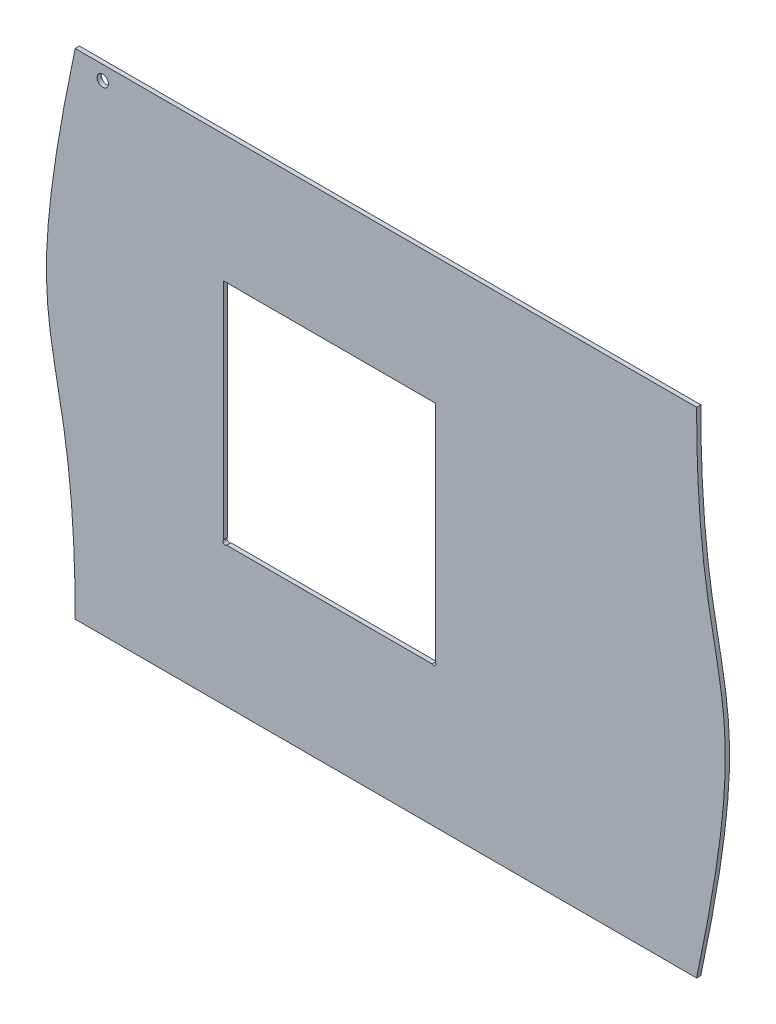
ISO-10303-21;
HEADER;
FILE_DESCRIPTION(('STEP AP214'),'2;1');
FILE_NAME('part.step','',(''),(''),'','','');
FILE_SCHEMA(('AUTOMOTIVE_DESIGN { 1 0 10303 214 1 1 1 1 }'));
ENDSEC;
DATA;
#1=APPLICATION_CONTEXT('core data for automotive mechanical design processes');
#2=APPLICATION_PROTOCOL_DEFINITION('international standard','automotive_design',2000,#1);
#3=PRODUCT_CONTEXT('',#1,'mechanical');
#4=PRODUCT('Part','Part','',(#3));
#5=PRODUCT_RELATED_PRODUCT_CATEGORY('part','',(#4));
#6=PRODUCT_DEFINITION_FORMATION('','',#4);
#7=PRODUCT_DEFINITION_CONTEXT('part definition',#1,'design');
#8=PRODUCT_DEFINITION('design','',#6,#7);
#9=PRODUCT_DEFINITION_SHAPE('','',#8);
#10=(LENGTH_UNIT() NAMED_UNIT(*) SI_UNIT(.MILLI.,.METRE.));
#11=(NAMED_UNIT(*) PLANE_ANGLE_UNIT() SI_UNIT($,.RADIAN.));
#12=(NAMED_UNIT(*) SI_UNIT($,.STERADIAN.) SOLID_ANGLE_UNIT());
#13=UNCERTAINTY_MEASURE_WITH_UNIT(LENGTH_MEASURE(1.E-05),#10,'distance_accuracy_value','');
#14=(GEOMETRIC_REPRESENTATION_CONTEXT(3) GLOBAL_UNCERTAINTY_ASSIGNED_CONTEXT((#13)) GLOBAL_UNIT_ASSIGNED_CONTEXT((#10,
#11,#12)) REPRESENTATION_CONTEXT('',''));
#15=CARTESIAN_POINT('',(0.,0.,0.));
#16=DIRECTION('',(0.,0.,1.));
#17=DIRECTION('',(1.,0.,0.));
#18=AXIS2_PLACEMENT_3D('',#15,#16,#17);
#19=CARTESIAN_POINT('',(447.160764324478,194.031130057544,3.));
#20=DIRECTION('',(0.,0.,-1.));
#21=DIRECTION('',(-1.,0.,0.));
#22=AXIS2_PLACEMENT_3D('',#19,#20,#21);
#23=PLANE('',#22);
#24=DIRECTION('',(-1.,0.,0.));
#25=VECTOR('',#24,1.);
#26=CARTESIAN_POINT('',(245.,268.,3.));
#27=LINE('',#26,#25);
#28=CARTESIAN_POINT('',(245.,268.,3.));
#29=VERTEX_POINT('',#28);
#30=CARTESIAN_POINT('',(95.,268.,3.));
#31=VERTEX_POINT('',#30);
#32=EDGE_CURVE('E110',#29,#31,#27,.T.);
#33=ORIENTED_EDGE('',*,*,#32,.F.);
#34=DIRECTION('',(0.,1.,0.));
#35=VECTOR('',#34,1.);
#36=CARTESIAN_POINT('',(245.,109.262741699797,3.));
#37=LINE('',#36,#35);
#38=CARTESIAN_POINT('',(245.,109.262741699797,3.));
#39=VERTEX_POINT('',#38);
#40=EDGE_CURVE('E141',#39,#29,#37,.T.);
#41=ORIENTED_EDGE('',*,*,#40,.F.);
#42=CARTESIAN_POINT('',(243.868629150102,108.131370849899,3.));
#43=DIRECTION('',(0.,0.,1.));
#44=DIRECTION('',(-1.,0.,0.));
#45=AXIS2_PLACEMENT_3D('',#42,#43,#44);
#46=CIRCLE('',#45,1.60000000000002);
#47=CARTESIAN_POINT('',(242.737258300203,107.,3.));
#48=VERTEX_POINT('',#47);
#49=EDGE_CURVE('E139',#48,#39,#46,.T.);
#50=ORIENTED_EDGE('',*,*,#49,.F.);
#51=DIRECTION('',(1.,0.,0.));
#52=VECTOR('',#51,1.);
#53=CARTESIAN_POINT('',(97.262741699797,107.,3.));
#54=LINE('',#53,#52);
#55=CARTESIAN_POINT('',(97.262741699797,107.,3.));
#56=VERTEX_POINT('',#55);
#57=EDGE_CURVE('E134',#56,#48,#54,.T.);
#58=ORIENTED_EDGE('',*,*,#57,.F.);
#59=CARTESIAN_POINT('',(96.1313708498985,108.131370849898,3.));
#60=DIRECTION('',(0.,0.,1.));
#61=DIRECTION('',(1.,0.,0.));
#62=AXIS2_PLACEMENT_3D('',#59,#60,#61);
#63=CIRCLE('',#62,1.6);
#64=CARTESIAN_POINT('',(95.,109.262741699797,3.));
#65=VERTEX_POINT('',#64);
#66=EDGE_CURVE('E132',#65,#56,#63,.T.);
#67=ORIENTED_EDGE('',*,*,#66,.F.);
#68=DIRECTION('',(0.,-1.,0.));
#69=VECTOR('',#68,1.);
#70=CARTESIAN_POINT('',(95.,268.,3.));
#71=LINE('',#70,#69);
#72=EDGE_CURVE('E118',#31,#65,#71,.T.);
#73=ORIENTED_EDGE('',*,*,#72,.F.);
#74=EDGE_LOOP('',(#33,#41,#50,#58,#67,#73));
#75=FACE_BOUND('',#74,.T.);
#76=CARTESIAN_POINT('',(430.,8.,3.));
#77=CARTESIAN_POINT('',(475.762038198805,224.874934930482,3.));
#78=CARTESIAN_POINT('',(429.999999999804,170.541411889636,3.));
#79=CARTESIAN_POINT('',(430.,358.000000000002,3.));
#80=B_SPLINE_CURVE_WITH_KNOTS('',3,(#76,#77,#78,#79),.UNSPECIFIED.,.F.,.F.,(4,4),(0.,1.),.UNSPECIFIED.);
#81=CARTESIAN_POINT('',(430.,8.,3.));
#82=VERTEX_POINT('',#81);
#83=CARTESIAN_POINT('',(430.,358.,3.));
#84=VERTEX_POINT('',#83);
#85=EDGE_CURVE('E163',#82,#84,#80,.T.);
#86=ORIENTED_EDGE('',*,*,#85,.T.);
#87=DIRECTION('',(-1.,0.,0.));
#88=VECTOR('',#87,1.);
#89=CARTESIAN_POINT('',(-10.0000000000001,358.,3.));
#90=LINE('',#89,#88);
#91=CARTESIAN_POINT('',(-10.,358.,3.));
#92=VERTEX_POINT('',#91);
#93=EDGE_CURVE('E169',#84,#92,#90,.T.);
#94=ORIENTED_EDGE('',*,*,#93,.T.);
#95=CARTESIAN_POINT('',(-10.,358.,3.));
#96=CARTESIAN_POINT('',(-55.7620381988046,141.125065069518,3.));
#97=CARTESIAN_POINT('',(-9.99999999999899,195.458588108931,3.));
#98=CARTESIAN_POINT('',(-9.99999999999995,7.99999999999817,3.));
#99=B_SPLINE_CURVE_WITH_KNOTS('',3,(#95,#96,#97,#98),.UNSPECIFIED.,.F.,.F.,(4,4),(0.,1.),.UNSPECIFIED.);
#100=CARTESIAN_POINT('',(-10.,8.,3.));
#101=VERTEX_POINT('',#100);
#102=EDGE_CURVE('E175',#92,#101,#99,.T.);
#103=ORIENTED_EDGE('',*,*,#102,.T.);
#104=DIRECTION('',(1.,0.,0.));
#105=VECTOR('',#104,1.);
#106=CARTESIAN_POINT('',(-10.,8.,3.));
#107=LINE('',#106,#105);
#108=EDGE_CURVE('E180',#101,#82,#107,.T.);
#109=ORIENTED_EDGE('',*,*,#108,.T.);
#110=EDGE_LOOP('',(#86,#94,#103,#109));
#111=FACE_BOUND('',#110,.T.);
#112=CARTESIAN_POINT('',(9.5,348.,3.));
#113=DIRECTION('',(0.,0.,1.));
#114=DIRECTION('',(1.,0.,0.));
#115=AXIS2_PLACEMENT_3D('',#112,#113,#114);
#116=CIRCLE('',#115,4.);
#117=CARTESIAN_POINT('',(13.5,348.,3.));
#118=VERTEX_POINT('',#117);
#119=EDGE_CURVE('E144',#118,#118,#116,.T.);
#120=ORIENTED_EDGE('',*,*,#119,.F.);
#121=EDGE_LOOP('',(#120));
#122=FACE_BOUND('',#121,.T.);
#123=ADVANCED_FACE('F32',(#75,#111,#122),#23,.F.);
#124=CARTESIAN_POINT('',(447.160764324478,194.031130057544,0.));
#125=DIRECTION('',(0.,0.,-1.));
#126=DIRECTION('',(-1.,0.,0.));
#127=AXIS2_PLACEMENT_3D('',#124,#125,#126);
#128=PLANE('',#127);
#129=DIRECTION('',(0.,1.,0.));
#130=VECTOR('',#129,1.);
#131=CARTESIAN_POINT('',(245.,109.262741699797,0.));
#132=LINE('',#131,#130);
#133=CARTESIAN_POINT('',(245.,109.262741699797,0.));
#134=VERTEX_POINT('',#133);
#135=CARTESIAN_POINT('',(245.,268.,0.));
#136=VERTEX_POINT('',#135);
#137=EDGE_CURVE('E119',#134,#136,#132,.T.);
#138=ORIENTED_EDGE('',*,*,#137,.T.);
#139=DIRECTION('',(-1.,0.,0.));
#140=VECTOR('',#139,1.);
#141=CARTESIAN_POINT('',(245.,268.,0.));
#142=LINE('',#141,#140);
#143=CARTESIAN_POINT('',(95.,268.,0.));
#144=VERTEX_POINT('',#143);
#145=EDGE_CURVE('E56',#136,#144,#142,.T.);
#146=ORIENTED_EDGE('',*,*,#145,.T.);
#147=DIRECTION('',(0.,-1.,0.));
#148=VECTOR('',#147,1.);
#149=CARTESIAN_POINT('',(95.,268.,0.));
#150=LINE('',#149,#148);
#151=CARTESIAN_POINT('',(95.,109.262741699797,0.));
#152=VERTEX_POINT('',#151);
#153=EDGE_CURVE('E125',#144,#152,#150,.T.);
#154=ORIENTED_EDGE('',*,*,#153,.T.);
#155=CARTESIAN_POINT('',(96.1313708498985,108.131370849898,0.));
#156=DIRECTION('',(0.,0.,1.));
#157=DIRECTION('',(1.,0.,0.));
#158=AXIS2_PLACEMENT_3D('',#155,#156,#157);
#159=CIRCLE('',#158,1.6);
#160=CARTESIAN_POINT('',(97.262741699797,107.,0.));
#161=VERTEX_POINT('',#160);
#162=EDGE_CURVE('E146',#152,#161,#159,.T.);
#163=ORIENTED_EDGE('',*,*,#162,.T.);
#164=DIRECTION('',(1.,0.,0.));
#165=VECTOR('',#164,1.);
#166=CARTESIAN_POINT('',(97.262741699797,107.,0.));
#167=LINE('',#166,#165);
#168=CARTESIAN_POINT('',(242.737258300203,107.,0.));
#169=VERTEX_POINT('',#168);
#170=EDGE_CURVE('E149',#161,#169,#167,.T.);
#171=ORIENTED_EDGE('',*,*,#170,.T.);
#172=CARTESIAN_POINT('',(243.868629150102,108.131370849899,0.));
#173=DIRECTION('',(0.,0.,1.));
#174=DIRECTION('',(-1.,0.,0.));
#175=AXIS2_PLACEMENT_3D('',#172,#173,#174);
#176=CIRCLE('',#175,1.60000000000002);
#177=EDGE_CURVE('E152',#169,#134,#176,.T.);
#178=ORIENTED_EDGE('',*,*,#177,.T.);
#179=EDGE_LOOP('',(#138,#146,#154,#163,#171,#178));
#180=FACE_BOUND('',#179,.T.);
#181=CARTESIAN_POINT('',(430.,8.,0.));
#182=CARTESIAN_POINT('',(475.762038198805,224.874934930482,0.));
#183=CARTESIAN_POINT('',(429.999999999804,170.541411889636,0.));
#184=CARTESIAN_POINT('',(430.,358.000000000002,0.));
#185=B_SPLINE_CURVE_WITH_KNOTS('',3,(#181,#182,#183,#184),.UNSPECIFIED.,.F.,.F.,(4,4),(0.,1.),.UNSPECIFIED.);
#186=CARTESIAN_POINT('',(430.,8.,0.));
#187=VERTEX_POINT('',#186);
#188=CARTESIAN_POINT('',(430.,358.,0.));
#189=VERTEX_POINT('',#188);
#190=EDGE_CURVE('E126',#187,#189,#185,.T.);
#191=ORIENTED_EDGE('',*,*,#190,.F.);
#192=DIRECTION('',(1.,0.,0.));
#193=VECTOR('',#192,1.);
#194=CARTESIAN_POINT('',(-10.,8.,0.));
#195=LINE('',#194,#193);
#196=CARTESIAN_POINT('',(-10.,8.,0.));
#197=VERTEX_POINT('',#196);
#198=EDGE_CURVE('E170',#197,#187,#195,.T.);
#199=ORIENTED_EDGE('',*,*,#198,.F.);
#200=CARTESIAN_POINT('',(-10.,358.,0.));
#201=CARTESIAN_POINT('',(-55.7620381988046,141.125065069518,0.));
#202=CARTESIAN_POINT('',(-9.99999999999899,195.458588108931,0.));
#203=CARTESIAN_POINT('',(-9.99999999999995,7.99999999999817,0.));
#204=B_SPLINE_CURVE_WITH_KNOTS('',3,(#200,#201,#202,#203),.UNSPECIFIED.,.F.,.F.,(4,4),(0.,1.),.UNSPECIFIED.);
#205=CARTESIAN_POINT('',(-10.,358.,0.));
#206=VERTEX_POINT('',#205);
#207=EDGE_CURVE('E326',#206,#197,#204,.T.);
#208=ORIENTED_EDGE('',*,*,#207,.F.);
#209=DIRECTION('',(-1.,0.,0.));
#210=VECTOR('',#209,1.);
#211=CARTESIAN_POINT('',(-10.0000000000001,358.,0.));
#212=LINE('',#211,#210);
#213=EDGE_CURVE('E331',#189,#206,#212,.T.);
#214=ORIENTED_EDGE('',*,*,#213,.F.);
#215=EDGE_LOOP('',(#191,#199,#208,#214));
#216=FACE_BOUND('',#215,.T.);
#217=CARTESIAN_POINT('',(9.5,348.,0.));
#218=DIRECTION('',(0.,0.,1.));
#219=DIRECTION('',(1.,0.,0.));
#220=AXIS2_PLACEMENT_3D('',#217,#218,#219);
#221=CIRCLE('',#220,4.);
#222=CARTESIAN_POINT('',(13.5,348.,0.));
#223=VERTEX_POINT('',#222);
#224=EDGE_CURVE('E236',#223,#223,#221,.T.);
#225=ORIENTED_EDGE('',*,*,#224,.T.);
#226=EDGE_LOOP('',(#225));
#227=FACE_BOUND('',#226,.T.);
#228=ADVANCED_FACE('F198',(#180,#216,#227),#128,.T.);
#229=DIRECTION('',(0.,0.,-1.));
#230=VECTOR('',#229,1.);
#231=SURFACE_OF_LINEAR_EXTRUSION('',#80,#230);
#232=ORIENTED_EDGE('',*,*,#190,.T.);
#233=DIRECTION('',(0.,0.,-1.));
#234=VECTOR('',#233,1.);
#235=CARTESIAN_POINT('',(430.,358.,3.));
#236=LINE('',#235,#234);
#237=EDGE_CURVE('E11',#84,#189,#236,.T.);
#238=ORIENTED_EDGE('',*,*,#237,.F.);
#239=ORIENTED_EDGE('',*,*,#85,.F.);
#240=DIRECTION('',(0.,0.,-1.));
#241=VECTOR('',#240,1.);
#242=CARTESIAN_POINT('',(430.,8.,3.));
#243=LINE('',#242,#241);
#244=EDGE_CURVE('E319',#82,#187,#243,.T.);
#245=ORIENTED_EDGE('',*,*,#244,.T.);
#246=EDGE_LOOP('',(#232,#238,#239,#245));
#247=FACE_BOUND('',#246,.T.);
#248=ADVANCED_FACE('F34',(#247),#231,.F.);
#249=CARTESIAN_POINT('',(-10.0000000000001,358.,3.));
#250=DIRECTION('',(0.,-1.,0.));
#251=DIRECTION('',(0.,0.,-1.));
#252=AXIS2_PLACEMENT_3D('',#249,#250,#251);
#253=PLANE('',#252);
#254=ORIENTED_EDGE('',*,*,#213,.T.);
#255=DIRECTION('',(0.,0.,-1.));
#256=VECTOR('',#255,1.);
#257=CARTESIAN_POINT('',(-10.,358.,3.));
#258=LINE('',#257,#256);
#259=EDGE_CURVE('E41',#92,#206,#258,.T.);
#260=ORIENTED_EDGE('',*,*,#259,.F.);
#261=ORIENTED_EDGE('',*,*,#93,.F.);
#262=ORIENTED_EDGE('',*,*,#237,.T.);
#263=EDGE_LOOP('',(#254,#260,#261,#262));
#264=FACE_BOUND('',#263,.T.);
#265=ADVANCED_FACE('F190',(#264),#253,.F.);
#266=DIRECTION('',(0.,0.,-1.));
#267=VECTOR('',#266,1.);
#268=SURFACE_OF_LINEAR_EXTRUSION('',#99,#267);
#269=ORIENTED_EDGE('',*,*,#207,.T.);
#270=DIRECTION('',(0.,0.,-1.));
#271=VECTOR('',#270,1.);
#272=CARTESIAN_POINT('',(-10.,8.,3.));
#273=LINE('',#272,#271);
#274=EDGE_CURVE('E322',#101,#197,#273,.T.);
#275=ORIENTED_EDGE('',*,*,#274,.F.);
#276=ORIENTED_EDGE('',*,*,#102,.F.);
#277=ORIENTED_EDGE('',*,*,#259,.T.);
#278=EDGE_LOOP('',(#269,#275,#276,#277));
#279=FACE_BOUND('',#278,.T.);
#280=ADVANCED_FACE('F186',(#279),#268,.F.);
#281=CARTESIAN_POINT('',(-10.,8.,3.));
#282=DIRECTION('',(0.,1.,0.));
#283=DIRECTION('',(0.,0.,1.));
#284=AXIS2_PLACEMENT_3D('',#281,#282,#283);
#285=PLANE('',#284);
#286=ORIENTED_EDGE('',*,*,#198,.T.);
#287=ORIENTED_EDGE('',*,*,#244,.F.);
#288=ORIENTED_EDGE('',*,*,#108,.F.);
#289=ORIENTED_EDGE('',*,*,#274,.T.);
#290=EDGE_LOOP('',(#286,#287,#288,#289));
#291=FACE_BOUND('',#290,.T.);
#292=ADVANCED_FACE('F189',(#291),#285,.F.);
#293=CARTESIAN_POINT('',(245.,268.,3.));
#294=DIRECTION('',(0.,-1.,0.));
#295=DIRECTION('',(1.,0.,0.));
#296=AXIS2_PLACEMENT_3D('',#293,#294,#295);
#297=PLANE('',#296);
#298=ORIENTED_EDGE('',*,*,#145,.F.);
#299=DIRECTION('',(0.,0.,-1.));
#300=VECTOR('',#299,1.);
#301=CARTESIAN_POINT('',(245.,268.,3.));
#302=LINE('',#301,#300);
#303=EDGE_CURVE('E114',#29,#136,#302,.T.);
#304=ORIENTED_EDGE('',*,*,#303,.F.);
#305=ORIENTED_EDGE('',*,*,#32,.T.);
#306=DIRECTION('',(0.,0.,-1.));
#307=VECTOR('',#306,1.);
#308=CARTESIAN_POINT('',(95.,268.,3.));
#309=LINE('',#308,#307);
#310=EDGE_CURVE('E113',#31,#144,#309,.T.);
#311=ORIENTED_EDGE('',*,*,#310,.T.);
#312=EDGE_LOOP('',(#298,#304,#305,#311));
#313=FACE_BOUND('',#312,.T.);
#314=ADVANCED_FACE('F112',(#313),#297,.T.);
#315=CARTESIAN_POINT('',(95.,268.,3.));
#316=DIRECTION('',(1.,0.,0.));
#317=DIRECTION('',(0.,0.,-1.));
#318=AXIS2_PLACEMENT_3D('',#315,#316,#317);
#319=PLANE('',#318);
#320=ORIENTED_EDGE('',*,*,#153,.F.);
#321=ORIENTED_EDGE('',*,*,#310,.F.);
#322=ORIENTED_EDGE('',*,*,#72,.T.);
#323=DIRECTION('',(0.,0.,-1.));
#324=VECTOR('',#323,1.);
#325=CARTESIAN_POINT('',(95.,109.262741699797,3.));
#326=LINE('',#325,#324);
#327=EDGE_CURVE('E127',#65,#152,#326,.T.);
#328=ORIENTED_EDGE('',*,*,#327,.T.);
#329=EDGE_LOOP('',(#320,#321,#322,#328));
#330=FACE_BOUND('',#329,.T.);
#331=ADVANCED_FACE('F122',(#330),#319,.T.);
#332=CARTESIAN_POINT('',(96.1313708498985,108.131370849898,3.));
#333=DIRECTION('',(0.,0.,-1.));
#334=DIRECTION('',(-1.,0.,0.));
#335=AXIS2_PLACEMENT_3D('',#332,#333,#334);
#336=CYLINDRICAL_SURFACE('',#335,1.6);
#337=ORIENTED_EDGE('',*,*,#162,.F.);
#338=ORIENTED_EDGE('',*,*,#327,.F.);
#339=ORIENTED_EDGE('',*,*,#66,.T.);
#340=DIRECTION('',(0.,0.,-1.));
#341=VECTOR('',#340,1.);
#342=CARTESIAN_POINT('',(97.262741699797,107.,3.));
#343=LINE('',#342,#341);
#344=EDGE_CURVE('E161',#56,#161,#343,.T.);
#345=ORIENTED_EDGE('',*,*,#344,.T.);
#346=EDGE_LOOP('',(#337,#338,#339,#345));
#347=FACE_BOUND('',#346,.T.);
#348=ADVANCED_FACE('F211',(#347),#336,.F.);
#349=CARTESIAN_POINT('',(97.262741699797,107.,3.));
#350=DIRECTION('',(0.,1.,0.));
#351=DIRECTION('',(0.,0.,1.));
#352=AXIS2_PLACEMENT_3D('',#349,#350,#351);
#353=PLANE('',#352);
#354=ORIENTED_EDGE('',*,*,#170,.F.);
#355=ORIENTED_EDGE('',*,*,#344,.F.);
#356=ORIENTED_EDGE('',*,*,#57,.T.);
#357=DIRECTION('',(0.,0.,-1.));
#358=VECTOR('',#357,1.);
#359=CARTESIAN_POINT('',(242.737258300203,107.,3.));
#360=LINE('',#359,#358);
#361=EDGE_CURVE('E159',#48,#169,#360,.T.);
#362=ORIENTED_EDGE('',*,*,#361,.T.);
#363=EDGE_LOOP('',(#354,#355,#356,#362));
#364=FACE_BOUND('',#363,.T.);
#365=ADVANCED_FACE('F214',(#364),#353,.T.);
#366=CARTESIAN_POINT('',(243.868629150102,108.131370849899,3.));
#367=DIRECTION('',(0.,0.,-1.));
#368=DIRECTION('',(-1.,0.,0.));
#369=AXIS2_PLACEMENT_3D('',#366,#367,#368);
#370=CYLINDRICAL_SURFACE('',#369,1.60000000000002);
#371=ORIENTED_EDGE('',*,*,#177,.F.);
#372=ORIENTED_EDGE('',*,*,#361,.F.);
#373=ORIENTED_EDGE('',*,*,#49,.T.);
#374=DIRECTION('',(0.,0.,-1.));
#375=VECTOR('',#374,1.);
#376=CARTESIAN_POINT('',(245.,109.262741699797,3.));
#377=LINE('',#376,#375);
#378=EDGE_CURVE('E48',#39,#134,#377,.T.);
#379=ORIENTED_EDGE('',*,*,#378,.T.);
#380=EDGE_LOOP('',(#371,#372,#373,#379));
#381=FACE_BOUND('',#380,.T.);
#382=ADVANCED_FACE('F218',(#381),#370,.F.);
#383=CARTESIAN_POINT('',(245.,109.262741699797,3.));
#384=DIRECTION('',(-1.,0.,0.));
#385=DIRECTION('',(0.,0.,1.));
#386=AXIS2_PLACEMENT_3D('',#383,#384,#385);
#387=PLANE('',#386);
#388=ORIENTED_EDGE('',*,*,#137,.F.);
#389=ORIENTED_EDGE('',*,*,#378,.F.);
#390=ORIENTED_EDGE('',*,*,#40,.T.);
#391=ORIENTED_EDGE('',*,*,#303,.T.);
#392=EDGE_LOOP('',(#388,#389,#390,#391));
#393=FACE_BOUND('',#392,.T.);
#394=ADVANCED_FACE('F222',(#393),#387,.T.);
#395=CARTESIAN_POINT('',(9.5,348.,3.));
#396=DIRECTION('',(0.,0.,-1.));
#397=DIRECTION('',(-1.,0.,0.));
#398=AXIS2_PLACEMENT_3D('',#395,#396,#397);
#399=CYLINDRICAL_SURFACE('',#398,4.);
#400=ORIENTED_EDGE('',*,*,#119,.T.);
#401=EDGE_LOOP('',(#400));
#402=FACE_BOUND('',#401,.T.);
#403=ORIENTED_EDGE('',*,*,#224,.F.);
#404=EDGE_LOOP('',(#403));
#405=FACE_BOUND('',#404,.T.);
#406=ADVANCED_FACE('F226',(#402,#405),#399,.F.);
#407=CLOSED_SHELL('',(#123,#228,#248,#265,#280,#292,#314,#331,#348,#365,#382,#394,#406));
#408=MANIFOLD_SOLID_BREP('B2',#407);
#409=ADVANCED_BREP_SHAPE_REPRESENTATION('',(#18,#408),#14);
#410=SHAPE_DEFINITION_REPRESENTATION(#9,#409);
ENDSEC;
END-ISO-10303-21;
